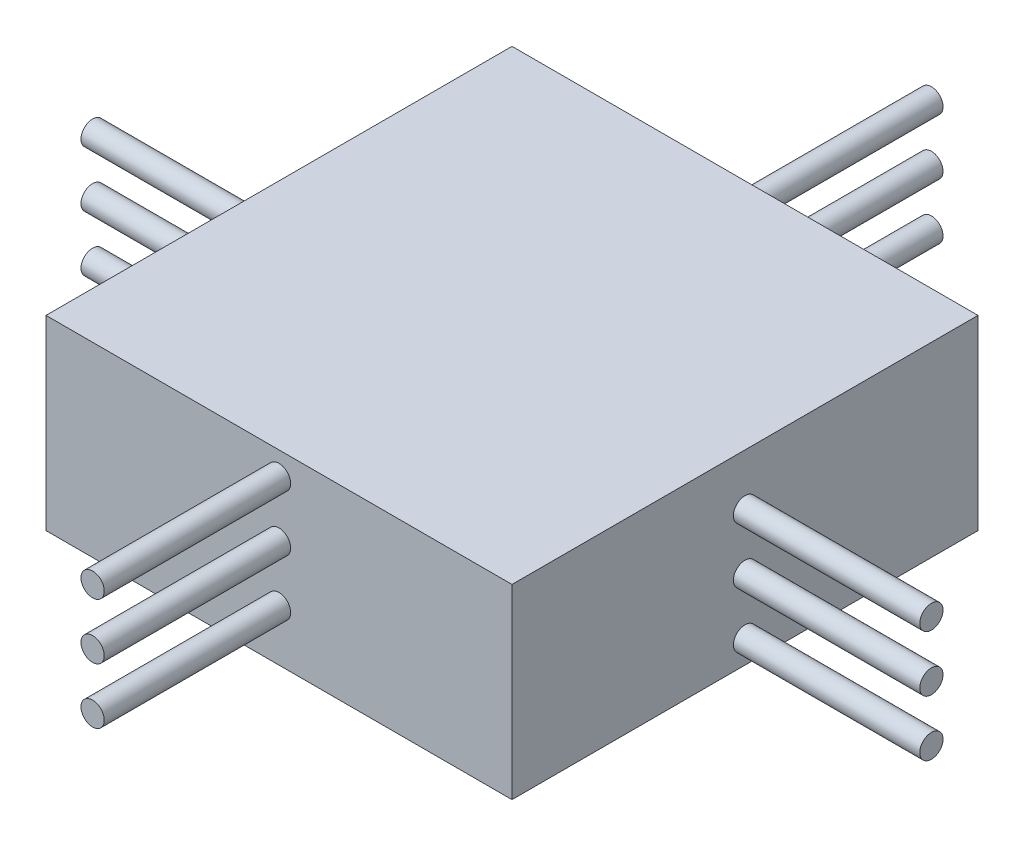
ISO-10303-21;
HEADER;
FILE_DESCRIPTION(('STEP AP214'),'2;1');
FILE_NAME('part.step','',(''),(''),'','','');
FILE_SCHEMA(('AUTOMOTIVE_DESIGN { 1 0 10303 214 1 1 1 1 }'));
ENDSEC;
DATA;
#1=APPLICATION_CONTEXT('core data for automotive mechanical design processes');
#2=APPLICATION_PROTOCOL_DEFINITION('international standard','automotive_design',2000,#1);
#3=PRODUCT_CONTEXT('',#1,'mechanical');
#4=PRODUCT('Part','Part','',(#3));
#5=PRODUCT_RELATED_PRODUCT_CATEGORY('part','',(#4));
#6=PRODUCT_DEFINITION_FORMATION('','',#4);
#7=PRODUCT_DEFINITION_CONTEXT('part definition',#1,'design');
#8=PRODUCT_DEFINITION('design','',#6,#7);
#9=PRODUCT_DEFINITION_SHAPE('','',#8);
#10=(LENGTH_UNIT() NAMED_UNIT(*) SI_UNIT(.MILLI.,.METRE.));
#11=(NAMED_UNIT(*) PLANE_ANGLE_UNIT() SI_UNIT($,.RADIAN.));
#12=(NAMED_UNIT(*) SI_UNIT($,.STERADIAN.) SOLID_ANGLE_UNIT());
#13=UNCERTAINTY_MEASURE_WITH_UNIT(LENGTH_MEASURE(1.E-05),#10,'distance_accuracy_value','');
#14=(GEOMETRIC_REPRESENTATION_CONTEXT(3) GLOBAL_UNCERTAINTY_ASSIGNED_CONTEXT((#13)) GLOBAL_UNIT_ASSIGNED_CONTEXT((#10,
#11,#12)) REPRESENTATION_CONTEXT('',''));
#15=CARTESIAN_POINT('',(0.,0.,0.));
#16=DIRECTION('',(0.,0.,1.));
#17=DIRECTION('',(1.,0.,0.));
#18=AXIS2_PLACEMENT_3D('',#15,#16,#17);
#19=CARTESIAN_POINT('',(-45.,2.5,-1.26366883937884E-13));
#20=DIRECTION('',(1.,0.,0.));
#21=DIRECTION('',(0.,0.,-1.));
#22=AXIS2_PLACEMENT_3D('',#19,#20,#21);
#23=CYLINDRICAL_SURFACE('',#22,1.25);
#24=CARTESIAN_POINT('',(-45.,2.5,-1.26366883937884E-13));
#25=DIRECTION('',(1.,0.,0.));
#26=DIRECTION('',(0.,0.,-1.));
#27=AXIS2_PLACEMENT_3D('',#24,#25,#26);
#28=CIRCLE('',#27,1.25);
#29=CARTESIAN_POINT('',(-45.,2.5,-1.25000000000013));
#30=VERTEX_POINT('',#29);
#31=EDGE_CURVE('E11',#30,#30,#28,.T.);
#32=ORIENTED_EDGE('',*,*,#31,.T.);
#33=EDGE_LOOP('',(#32));
#34=FACE_BOUND('',#33,.T.);
#35=CARTESIAN_POINT('',(45.,2.5,-1.26366883937884E-13));
#36=DIRECTION('',(1.,0.,0.));
#37=DIRECTION('',(0.,0.,-1.));
#38=AXIS2_PLACEMENT_3D('',#35,#36,#37);
#39=CIRCLE('',#38,1.25);
#40=CARTESIAN_POINT('',(45.,2.5,-1.25000000000013));
#41=VERTEX_POINT('',#40);
#42=EDGE_CURVE('E46',#41,#41,#39,.T.);
#43=ORIENTED_EDGE('',*,*,#42,.F.);
#44=EDGE_LOOP('',(#43));
#45=FACE_BOUND('',#44,.T.);
#46=ADVANCED_FACE('F40',(#34,#45),#23,.T.);
#47=CARTESIAN_POINT('',(-45.,2.5,-1.26366883937884E-13));
#48=DIRECTION('',(1.,0.,0.));
#49=DIRECTION('',(0.,0.,-1.));
#50=AXIS2_PLACEMENT_3D('',#47,#48,#49);
#51=PLANE('',#50);
#52=ORIENTED_EDGE('',*,*,#31,.F.);
#53=EDGE_LOOP('',(#52));
#54=FACE_BOUND('',#53,.T.);
#55=ADVANCED_FACE('F55',(#54),#51,.F.);
#56=CARTESIAN_POINT('',(45.,2.5,-1.26366883937884E-13));
#57=DIRECTION('',(1.,0.,0.));
#58=DIRECTION('',(0.,0.,-1.));
#59=AXIS2_PLACEMENT_3D('',#56,#57,#58);
#60=PLANE('',#59);
#61=ORIENTED_EDGE('',*,*,#42,.T.);
#62=EDGE_LOOP('',(#61));
#63=FACE_BOUND('',#62,.T.);
#64=ADVANCED_FACE('F52',(#63),#60,.T.);
#65=CLOSED_SHELL('',(#46,#55,#64));
#66=MANIFOLD_SOLID_BREP('B2',#65);
#67=CARTESIAN_POINT('',(-45.,8.5,0.));
#68=DIRECTION('',(1.,0.,0.));
#69=DIRECTION('',(0.,0.,-1.));
#70=AXIS2_PLACEMENT_3D('',#67,#68,#69);
#71=CYLINDRICAL_SURFACE('',#70,1.25);
#72=CARTESIAN_POINT('',(-45.,8.5,0.));
#73=DIRECTION('',(1.,0.,0.));
#74=DIRECTION('',(0.,0.,-1.));
#75=AXIS2_PLACEMENT_3D('',#72,#73,#74);
#76=CIRCLE('',#75,1.25);
#77=CARTESIAN_POINT('',(-45.,8.5,-1.25000000000006));
#78=VERTEX_POINT('',#77);
#79=EDGE_CURVE('E39',#78,#78,#76,.T.);
#80=ORIENTED_EDGE('',*,*,#79,.T.);
#81=EDGE_LOOP('',(#80));
#82=FACE_BOUND('',#81,.T.);
#83=CARTESIAN_POINT('',(45.,8.5,0.));
#84=DIRECTION('',(1.,0.,0.));
#85=DIRECTION('',(0.,0.,-1.));
#86=AXIS2_PLACEMENT_3D('',#83,#84,#85);
#87=CIRCLE('',#86,1.25);
#88=CARTESIAN_POINT('',(45.,8.5,-1.25000000000006));
#89=VERTEX_POINT('',#88);
#90=EDGE_CURVE('E95',#89,#89,#87,.T.);
#91=ORIENTED_EDGE('',*,*,#90,.F.);
#92=EDGE_LOOP('',(#91));
#93=FACE_BOUND('',#92,.T.);
#94=ADVANCED_FACE('F89',(#82,#93),#71,.T.);
#95=CARTESIAN_POINT('',(-45.,8.5,0.));
#96=DIRECTION('',(1.,0.,0.));
#97=DIRECTION('',(0.,0.,-1.));
#98=AXIS2_PLACEMENT_3D('',#95,#96,#97);
#99=PLANE('',#98);
#100=ORIENTED_EDGE('',*,*,#79,.F.);
#101=EDGE_LOOP('',(#100));
#102=FACE_BOUND('',#101,.T.);
#103=ADVANCED_FACE('F104',(#102),#99,.F.);
#104=CARTESIAN_POINT('',(45.,8.5,0.));
#105=DIRECTION('',(1.,0.,0.));
#106=DIRECTION('',(0.,0.,-1.));
#107=AXIS2_PLACEMENT_3D('',#104,#105,#106);
#108=PLANE('',#107);
#109=ORIENTED_EDGE('',*,*,#90,.T.);
#110=EDGE_LOOP('',(#109));
#111=FACE_BOUND('',#110,.T.);
#112=ADVANCED_FACE('F101',(#111),#108,.T.);
#113=CLOSED_SHELL('',(#94,#103,#112));
#114=MANIFOLD_SOLID_BREP('B6',#113);
#115=CARTESIAN_POINT('',(-45.,14.5,0.));
#116=DIRECTION('',(1.,0.,0.));
#117=DIRECTION('',(0.,0.,-1.));
#118=AXIS2_PLACEMENT_3D('',#115,#116,#117);
#119=CYLINDRICAL_SURFACE('',#118,1.25);
#120=CARTESIAN_POINT('',(-45.,14.5,0.));
#121=DIRECTION('',(1.,0.,0.));
#122=DIRECTION('',(0.,0.,-1.));
#123=AXIS2_PLACEMENT_3D('',#120,#121,#122);
#124=CIRCLE('',#123,1.25);
#125=CARTESIAN_POINT('',(-45.,14.5,-1.25));
#126=VERTEX_POINT('',#125);
#127=EDGE_CURVE('E88',#126,#126,#124,.T.);
#128=ORIENTED_EDGE('',*,*,#127,.T.);
#129=EDGE_LOOP('',(#128));
#130=FACE_BOUND('',#129,.T.);
#131=CARTESIAN_POINT('',(45.,14.5,0.));
#132=DIRECTION('',(1.,0.,0.));
#133=DIRECTION('',(0.,0.,-1.));
#134=AXIS2_PLACEMENT_3D('',#131,#132,#133);
#135=CIRCLE('',#134,1.25);
#136=CARTESIAN_POINT('',(45.,14.5,-1.25));
#137=VERTEX_POINT('',#136);
#138=EDGE_CURVE('E144',#137,#137,#135,.T.);
#139=ORIENTED_EDGE('',*,*,#138,.F.);
#140=EDGE_LOOP('',(#139));
#141=FACE_BOUND('',#140,.T.);
#142=ADVANCED_FACE('F138',(#130,#141),#119,.T.);
#143=CARTESIAN_POINT('',(-45.,14.5,0.));
#144=DIRECTION('',(1.,0.,0.));
#145=DIRECTION('',(0.,0.,-1.));
#146=AXIS2_PLACEMENT_3D('',#143,#144,#145);
#147=PLANE('',#146);
#148=ORIENTED_EDGE('',*,*,#127,.F.);
#149=EDGE_LOOP('',(#148));
#150=FACE_BOUND('',#149,.T.);
#151=ADVANCED_FACE('F153',(#150),#147,.F.);
#152=CARTESIAN_POINT('',(45.,14.5,0.));
#153=DIRECTION('',(1.,0.,0.));
#154=DIRECTION('',(0.,0.,-1.));
#155=AXIS2_PLACEMENT_3D('',#152,#153,#154);
#156=PLANE('',#155);
#157=ORIENTED_EDGE('',*,*,#138,.T.);
#158=EDGE_LOOP('',(#157));
#159=FACE_BOUND('',#158,.T.);
#160=ADVANCED_FACE('F150',(#159),#156,.T.);
#161=CLOSED_SHELL('',(#142,#151,#160));
#162=MANIFOLD_SOLID_BREP('B34',#161);
#163=CARTESIAN_POINT('',(1.29468936850093E-13,5.5,-45.));
#164=DIRECTION('',(0.,0.,1.));
#165=DIRECTION('',(1.,0.,0.));
#166=AXIS2_PLACEMENT_3D('',#163,#164,#165);
#167=CYLINDRICAL_SURFACE('',#166,1.25);
#168=CARTESIAN_POINT('',(1.29468936850093E-13,5.5,-45.));
#169=DIRECTION('',(0.,0.,1.));
#170=DIRECTION('',(1.,0.,0.));
#171=AXIS2_PLACEMENT_3D('',#168,#169,#170);
#172=CIRCLE('',#171,1.25);
#173=CARTESIAN_POINT('',(1.25000000000013,5.5,-45.));
#174=VERTEX_POINT('',#173);
#175=EDGE_CURVE('E137',#174,#174,#172,.T.);
#176=ORIENTED_EDGE('',*,*,#175,.T.);
#177=EDGE_LOOP('',(#176));
#178=FACE_BOUND('',#177,.T.);
#179=CARTESIAN_POINT('',(1.29468936850093E-13,5.5,45.));
#180=DIRECTION('',(0.,0.,1.));
#181=DIRECTION('',(1.,0.,0.));
#182=AXIS2_PLACEMENT_3D('',#179,#180,#181);
#183=CIRCLE('',#182,1.25);
#184=CARTESIAN_POINT('',(1.25000000000013,5.5,45.));
#185=VERTEX_POINT('',#184);
#186=EDGE_CURVE('E193',#185,#185,#183,.T.);
#187=ORIENTED_EDGE('',*,*,#186,.F.);
#188=EDGE_LOOP('',(#187));
#189=FACE_BOUND('',#188,.T.);
#190=ADVANCED_FACE('F187',(#178,#189),#167,.T.);
#191=CARTESIAN_POINT('',(1.29468936850093E-13,5.5,-45.));
#192=DIRECTION('',(0.,0.,1.));
#193=DIRECTION('',(1.,0.,0.));
#194=AXIS2_PLACEMENT_3D('',#191,#192,#193);
#195=PLANE('',#194);
#196=ORIENTED_EDGE('',*,*,#175,.F.);
#197=EDGE_LOOP('',(#196));
#198=FACE_BOUND('',#197,.T.);
#199=ADVANCED_FACE('F202',(#198),#195,.F.);
#200=CARTESIAN_POINT('',(1.29468936850093E-13,5.5,45.));
#201=DIRECTION('',(0.,0.,1.));
#202=DIRECTION('',(1.,0.,0.));
#203=AXIS2_PLACEMENT_3D('',#200,#201,#202);
#204=PLANE('',#203);
#205=ORIENTED_EDGE('',*,*,#186,.T.);
#206=EDGE_LOOP('',(#205));
#207=FACE_BOUND('',#206,.T.);
#208=ADVANCED_FACE('F199',(#207),#204,.T.);
#209=CLOSED_SHELL('',(#190,#199,#208));
#210=MANIFOLD_SOLID_BREP('B83',#209);
#211=CARTESIAN_POINT('',(0.,11.5,-45.));
#212=DIRECTION('',(0.,0.,1.));
#213=DIRECTION('',(1.,0.,0.));
#214=AXIS2_PLACEMENT_3D('',#211,#212,#213);
#215=CYLINDRICAL_SURFACE('',#214,1.25);
#216=CARTESIAN_POINT('',(0.,11.5,-45.));
#217=DIRECTION('',(0.,0.,1.));
#218=DIRECTION('',(1.,0.,0.));
#219=AXIS2_PLACEMENT_3D('',#216,#217,#218);
#220=CIRCLE('',#219,1.25);
#221=CARTESIAN_POINT('',(1.25000000000007,11.5,-45.));
#222=VERTEX_POINT('',#221);
#223=EDGE_CURVE('E186',#222,#222,#220,.T.);
#224=ORIENTED_EDGE('',*,*,#223,.T.);
#225=EDGE_LOOP('',(#224));
#226=FACE_BOUND('',#225,.T.);
#227=CARTESIAN_POINT('',(0.,11.5,45.));
#228=DIRECTION('',(0.,0.,1.));
#229=DIRECTION('',(1.,0.,0.));
#230=AXIS2_PLACEMENT_3D('',#227,#228,#229);
#231=CIRCLE('',#230,1.25);
#232=CARTESIAN_POINT('',(1.25000000000007,11.5,45.));
#233=VERTEX_POINT('',#232);
#234=EDGE_CURVE('E242',#233,#233,#231,.T.);
#235=ORIENTED_EDGE('',*,*,#234,.F.);
#236=EDGE_LOOP('',(#235));
#237=FACE_BOUND('',#236,.T.);
#238=ADVANCED_FACE('F236',(#226,#237),#215,.T.);
#239=CARTESIAN_POINT('',(0.,11.5,-45.));
#240=DIRECTION('',(0.,0.,1.));
#241=DIRECTION('',(1.,0.,0.));
#242=AXIS2_PLACEMENT_3D('',#239,#240,#241);
#243=PLANE('',#242);
#244=ORIENTED_EDGE('',*,*,#223,.F.);
#245=EDGE_LOOP('',(#244));
#246=FACE_BOUND('',#245,.T.);
#247=ADVANCED_FACE('F251',(#246),#243,.F.);
#248=CARTESIAN_POINT('',(0.,11.5,45.));
#249=DIRECTION('',(0.,0.,1.));
#250=DIRECTION('',(1.,0.,0.));
#251=AXIS2_PLACEMENT_3D('',#248,#249,#250);
#252=PLANE('',#251);
#253=ORIENTED_EDGE('',*,*,#234,.T.);
#254=EDGE_LOOP('',(#253));
#255=FACE_BOUND('',#254,.T.);
#256=ADVANCED_FACE('F248',(#255),#252,.T.);
#257=CLOSED_SHELL('',(#238,#247,#256));
#258=MANIFOLD_SOLID_BREP('B132',#257);
#259=CARTESIAN_POINT('',(0.,17.5,-45.));
#260=DIRECTION('',(0.,0.,1.));
#261=DIRECTION('',(1.,0.,0.));
#262=AXIS2_PLACEMENT_3D('',#259,#260,#261);
#263=CYLINDRICAL_SURFACE('',#262,1.25);
#264=CARTESIAN_POINT('',(0.,17.5,-45.));
#265=DIRECTION('',(0.,0.,1.));
#266=DIRECTION('',(1.,0.,0.));
#267=AXIS2_PLACEMENT_3D('',#264,#265,#266);
#268=CIRCLE('',#267,1.25);
#269=CARTESIAN_POINT('',(1.25,17.5,-45.));
#270=VERTEX_POINT('',#269);
#271=EDGE_CURVE('E235',#270,#270,#268,.T.);
#272=ORIENTED_EDGE('',*,*,#271,.T.);
#273=EDGE_LOOP('',(#272));
#274=FACE_BOUND('',#273,.T.);
#275=CARTESIAN_POINT('',(0.,17.5,45.));
#276=DIRECTION('',(0.,0.,1.));
#277=DIRECTION('',(1.,0.,0.));
#278=AXIS2_PLACEMENT_3D('',#275,#276,#277);
#279=CIRCLE('',#278,1.25);
#280=CARTESIAN_POINT('',(1.25,17.5,45.));
#281=VERTEX_POINT('',#280);
#282=EDGE_CURVE('E292',#281,#281,#279,.T.);
#283=ORIENTED_EDGE('',*,*,#282,.F.);
#284=EDGE_LOOP('',(#283));
#285=FACE_BOUND('',#284,.T.);
#286=ADVANCED_FACE('F286',(#274,#285),#263,.T.);
#287=CARTESIAN_POINT('',(0.,17.5,-45.));
#288=DIRECTION('',(0.,0.,1.));
#289=DIRECTION('',(1.,0.,0.));
#290=AXIS2_PLACEMENT_3D('',#287,#288,#289);
#291=PLANE('',#290);
#292=ORIENTED_EDGE('',*,*,#271,.F.);
#293=EDGE_LOOP('',(#292));
#294=FACE_BOUND('',#293,.T.);
#295=ADVANCED_FACE('F301',(#294),#291,.F.);
#296=CARTESIAN_POINT('',(0.,17.5,45.));
#297=DIRECTION('',(0.,0.,1.));
#298=DIRECTION('',(1.,0.,0.));
#299=AXIS2_PLACEMENT_3D('',#296,#297,#298);
#300=PLANE('',#299);
#301=ORIENTED_EDGE('',*,*,#282,.T.);
#302=EDGE_LOOP('',(#301));
#303=FACE_BOUND('',#302,.T.);
#304=ADVANCED_FACE('F298',(#303),#300,.T.);
#305=CLOSED_SHELL('',(#286,#295,#304));
#306=MANIFOLD_SOLID_BREP('B181',#305);
#307=CARTESIAN_POINT('',(-25.,20.,25.));
#308=DIRECTION('',(1.,0.,0.));
#309=DIRECTION('',(0.,0.,-1.));
#310=AXIS2_PLACEMENT_3D('',#307,#308,#309);
#311=PLANE('',#310);
#312=DIRECTION('',(0.,0.,1.));
#313=VECTOR('',#312,1.);
#314=CARTESIAN_POINT('',(-25.,0.,25.));
#315=LINE('',#314,#313);
#316=CARTESIAN_POINT('',(-25.,0.,-25.));
#317=VERTEX_POINT('',#316);
#318=CARTESIAN_POINT('',(-25.,0.,25.));
#319=VERTEX_POINT('',#318);
#320=EDGE_CURVE('E390',#317,#319,#315,.T.);
#321=ORIENTED_EDGE('',*,*,#320,.T.);
#322=DIRECTION('',(0.,-1.,0.));
#323=VECTOR('',#322,1.);
#324=CARTESIAN_POINT('',(-25.,20.,25.));
#325=LINE('',#324,#323);
#326=CARTESIAN_POINT('',(-25.,20.,25.));
#327=VERTEX_POINT('',#326);
#328=EDGE_CURVE('E284',#327,#319,#325,.T.);
#329=ORIENTED_EDGE('',*,*,#328,.F.);
#330=DIRECTION('',(0.,0.,1.));
#331=VECTOR('',#330,1.);
#332=CARTESIAN_POINT('',(-25.,20.,25.));
#333=LINE('',#332,#331);
#334=CARTESIAN_POINT('',(-25.,20.,-25.));
#335=VERTEX_POINT('',#334);
#336=EDGE_CURVE('E378',#335,#327,#333,.T.);
#337=ORIENTED_EDGE('',*,*,#336,.F.);
#338=DIRECTION('',(0.,-1.,0.));
#339=VECTOR('',#338,1.);
#340=CARTESIAN_POINT('',(-25.,20.,-25.));
#341=LINE('',#340,#339);
#342=EDGE_CURVE('E386',#335,#317,#341,.T.);
#343=ORIENTED_EDGE('',*,*,#342,.T.);
#344=EDGE_LOOP('',(#321,#329,#337,#343));
#345=FACE_BOUND('',#344,.T.);
#346=ADVANCED_FACE('F327',(#345),#311,.F.);
#347=CARTESIAN_POINT('',(25.,20.,25.));
#348=DIRECTION('',(0.,0.,-1.));
#349=DIRECTION('',(-1.,0.,0.));
#350=AXIS2_PLACEMENT_3D('',#347,#348,#349);
#351=PLANE('',#350);
#352=DIRECTION('',(1.,0.,0.));
#353=VECTOR('',#352,1.);
#354=CARTESIAN_POINT('',(25.,0.,25.));
#355=LINE('',#354,#353);
#356=CARTESIAN_POINT('',(25.,0.,25.));
#357=VERTEX_POINT('',#356);
#358=EDGE_CURVE('E382',#319,#357,#355,.T.);
#359=ORIENTED_EDGE('',*,*,#358,.T.);
#360=DIRECTION('',(0.,-1.,0.));
#361=VECTOR('',#360,1.);
#362=CARTESIAN_POINT('',(25.,20.,25.));
#363=LINE('',#362,#361);
#364=CARTESIAN_POINT('',(25.,20.,25.));
#365=VERTEX_POINT('',#364);
#366=EDGE_CURVE('E335',#365,#357,#363,.T.);
#367=ORIENTED_EDGE('',*,*,#366,.F.);
#368=DIRECTION('',(1.,0.,0.));
#369=VECTOR('',#368,1.);
#370=CARTESIAN_POINT('',(25.,20.,25.));
#371=LINE('',#370,#369);
#372=EDGE_CURVE('E373',#327,#365,#371,.T.);
#373=ORIENTED_EDGE('',*,*,#372,.F.);
#374=ORIENTED_EDGE('',*,*,#328,.T.);
#375=EDGE_LOOP('',(#359,#367,#373,#374));
#376=FACE_BOUND('',#375,.T.);
#377=ADVANCED_FACE('F381',(#376),#351,.F.);
#378=CARTESIAN_POINT('',(25.,20.,25.));
#379=DIRECTION('',(-1.,0.,0.));
#380=DIRECTION('',(0.,0.,1.));
#381=AXIS2_PLACEMENT_3D('',#378,#379,#380);
#382=PLANE('',#381);
#383=DIRECTION('',(0.,0.,-1.));
#384=VECTOR('',#383,1.);
#385=CARTESIAN_POINT('',(25.,0.,25.));
#386=LINE('',#385,#384);
#387=CARTESIAN_POINT('',(25.,0.,-25.));
#388=VERTEX_POINT('',#387);
#389=EDGE_CURVE('E360',#357,#388,#386,.T.);
#390=ORIENTED_EDGE('',*,*,#389,.T.);
#391=DIRECTION('',(0.,-1.,0.));
#392=VECTOR('',#391,1.);
#393=CARTESIAN_POINT('',(25.,20.,-25.));
#394=LINE('',#393,#392);
#395=CARTESIAN_POINT('',(25.,20.,-25.));
#396=VERTEX_POINT('',#395);
#397=EDGE_CURVE('E383',#396,#388,#394,.T.);
#398=ORIENTED_EDGE('',*,*,#397,.F.);
#399=DIRECTION('',(0.,0.,-1.));
#400=VECTOR('',#399,1.);
#401=CARTESIAN_POINT('',(25.,20.,25.));
#402=LINE('',#401,#400);
#403=EDGE_CURVE('E376',#365,#396,#402,.T.);
#404=ORIENTED_EDGE('',*,*,#403,.F.);
#405=ORIENTED_EDGE('',*,*,#366,.T.);
#406=EDGE_LOOP('',(#390,#398,#404,#405));
#407=FACE_BOUND('',#406,.T.);
#408=ADVANCED_FACE('F384',(#407),#382,.F.);
#409=CARTESIAN_POINT('',(25.,20.,-25.));
#410=DIRECTION('',(0.,0.,1.));
#411=DIRECTION('',(1.,0.,0.));
#412=AXIS2_PLACEMENT_3D('',#409,#410,#411);
#413=PLANE('',#412);
#414=DIRECTION('',(-1.,0.,0.));
#415=VECTOR('',#414,1.);
#416=CARTESIAN_POINT('',(25.,0.,-25.));
#417=LINE('',#416,#415);
#418=EDGE_CURVE('E366',#388,#317,#417,.T.);
#419=ORIENTED_EDGE('',*,*,#418,.T.);
#420=ORIENTED_EDGE('',*,*,#342,.F.);
#421=DIRECTION('',(-1.,0.,0.));
#422=VECTOR('',#421,1.);
#423=CARTESIAN_POINT('',(25.,20.,-25.));
#424=LINE('',#423,#422);
#425=EDGE_CURVE('E343',#396,#335,#424,.T.);
#426=ORIENTED_EDGE('',*,*,#425,.F.);
#427=ORIENTED_EDGE('',*,*,#397,.T.);
#428=EDGE_LOOP('',(#419,#420,#426,#427));
#429=FACE_BOUND('',#428,.T.);
#430=ADVANCED_FACE('F397',(#429),#413,.F.);
#431=CARTESIAN_POINT('',(0.,20.,0.));
#432=DIRECTION('',(0.,1.,0.));
#433=DIRECTION('',(0.,0.,1.));
#434=AXIS2_PLACEMENT_3D('',#431,#432,#433);
#435=PLANE('',#434);
#436=ORIENTED_EDGE('',*,*,#336,.T.);
#437=ORIENTED_EDGE('',*,*,#372,.T.);
#438=ORIENTED_EDGE('',*,*,#403,.T.);
#439=ORIENTED_EDGE('',*,*,#425,.T.);
#440=EDGE_LOOP('',(#436,#437,#438,#439));
#441=FACE_BOUND('',#440,.T.);
#442=ADVANCED_FACE('F374',(#441),#435,.T.);
#443=CARTESIAN_POINT('',(0.,0.,0.));
#444=DIRECTION('',(0.,1.,0.));
#445=DIRECTION('',(0.,0.,1.));
#446=AXIS2_PLACEMENT_3D('',#443,#444,#445);
#447=PLANE('',#446);
#448=ORIENTED_EDGE('',*,*,#320,.F.);
#449=ORIENTED_EDGE('',*,*,#418,.F.);
#450=ORIENTED_EDGE('',*,*,#389,.F.);
#451=ORIENTED_EDGE('',*,*,#358,.F.);
#452=EDGE_LOOP('',(#448,#449,#450,#451));
#453=FACE_BOUND('',#452,.T.);
#454=ADVANCED_FACE('F400',(#453),#447,.F.);
#455=CLOSED_SHELL('',(#346,#377,#408,#430,#442,#454));
#456=MANIFOLD_SOLID_BREP('B230',#455);
#457=ADVANCED_BREP_SHAPE_REPRESENTATION('',(#18,#66,#114,#162,#210,#258,#306,#456),#14);
#458=SHAPE_DEFINITION_REPRESENTATION(#9,#457);
ENDSEC;
END-ISO-10303-21;
